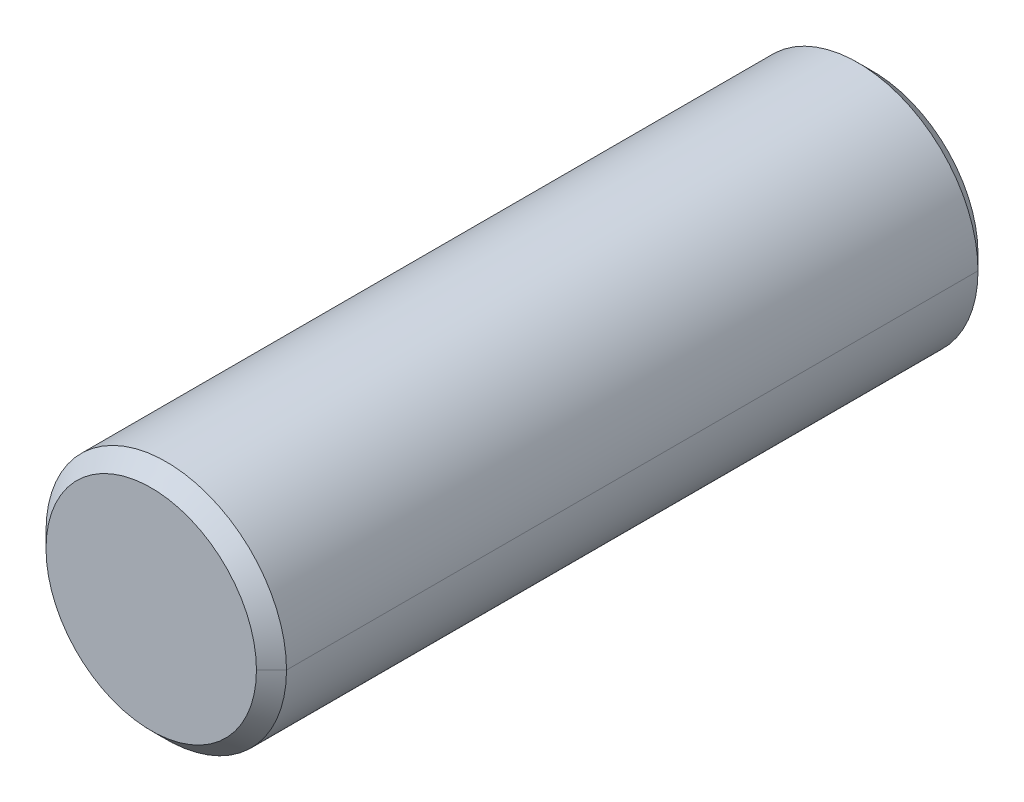
ISO-10303-21;
HEADER;
FILE_DESCRIPTION(('STEP AP214'),'2;1');
FILE_NAME('part.step','',(''),(''),'','','');
FILE_SCHEMA(('AUTOMOTIVE_DESIGN { 1 0 10303 214 1 1 1 1 }'));
ENDSEC;
DATA;
#1=APPLICATION_CONTEXT('core data for automotive mechanical design processes');
#2=APPLICATION_PROTOCOL_DEFINITION('international standard','automotive_design',2000,#1);
#3=PRODUCT_CONTEXT('',#1,'mechanical');
#4=PRODUCT('Part','Part','',(#3));
#5=PRODUCT_RELATED_PRODUCT_CATEGORY('part','',(#4));
#6=PRODUCT_DEFINITION_FORMATION('','',#4);
#7=PRODUCT_DEFINITION_CONTEXT('part definition',#1,'design');
#8=PRODUCT_DEFINITION('design','',#6,#7);
#9=PRODUCT_DEFINITION_SHAPE('','',#8);
#10=(LENGTH_UNIT() NAMED_UNIT(*) SI_UNIT(.MILLI.,.METRE.));
#11=(NAMED_UNIT(*) PLANE_ANGLE_UNIT() SI_UNIT($,.RADIAN.));
#12=(NAMED_UNIT(*) SI_UNIT($,.STERADIAN.) SOLID_ANGLE_UNIT());
#13=UNCERTAINTY_MEASURE_WITH_UNIT(LENGTH_MEASURE(1.E-05),#10,'distance_accuracy_value','');
#14=(GEOMETRIC_REPRESENTATION_CONTEXT(3) GLOBAL_UNCERTAINTY_ASSIGNED_CONTEXT((#13)) GLOBAL_UNIT_ASSIGNED_CONTEXT((#10,
#11,#12)) REPRESENTATION_CONTEXT('',''));
#15=CARTESIAN_POINT('',(0.,0.,0.));
#16=DIRECTION('',(0.,0.,1.));
#17=DIRECTION('',(1.,0.,0.));
#18=AXIS2_PLACEMENT_3D('',#15,#16,#17);
#19=CARTESIAN_POINT('',(0.,0.,6.));
#20=DIRECTION('',(0.,0.,-1.));
#21=DIRECTION('',(-1.,0.,0.));
#22=AXIS2_PLACEMENT_3D('',#19,#20,#21);
#23=CONICAL_SURFACE('',#22,1.75,0.785398163397448);
#24=DIRECTION('',(0.707106781186552,0.,-0.707106781186544));
#25=VECTOR('',#24,1.);
#26=CARTESIAN_POINT('',(1.75,0.,6.));
#27=LINE('',#26,#25);
#28=CARTESIAN_POINT('',(1.75,0.,6.));
#29=VERTEX_POINT('',#28);
#30=CARTESIAN_POINT('',(2.,0.,5.75));
#31=VERTEX_POINT('',#30);
#32=EDGE_CURVE('E78',#29,#31,#27,.T.);
#33=ORIENTED_EDGE('',*,*,#32,.F.);
#34=CARTESIAN_POINT('',(0.,0.,6.));
#35=DIRECTION('',(0.,0.,1.));
#36=DIRECTION('',(1.,0.,0.));
#37=AXIS2_PLACEMENT_3D('',#34,#35,#36);
#38=CIRCLE('',#37,1.75);
#39=CARTESIAN_POINT('',(-1.75,0.,6.));
#40=VERTEX_POINT('',#39);
#41=EDGE_CURVE('E27',#40,#29,#38,.T.);
#42=ORIENTED_EDGE('',*,*,#41,.F.);
#43=DIRECTION('',(-0.707106781186552,0.,-0.707106781186544));
#44=VECTOR('',#43,1.);
#45=CARTESIAN_POINT('',(-1.75,0.,6.));
#46=LINE('',#45,#44);
#47=CARTESIAN_POINT('',(-2.,0.,5.75));
#48=VERTEX_POINT('',#47);
#49=EDGE_CURVE('E86',#40,#48,#46,.T.);
#50=ORIENTED_EDGE('',*,*,#49,.T.);
#51=CARTESIAN_POINT('',(0.,0.,5.75));
#52=DIRECTION('',(0.,0.,-1.));
#53=DIRECTION('',(1.,0.,0.));
#54=AXIS2_PLACEMENT_3D('',#51,#52,#53);
#55=CIRCLE('',#54,2.);
#56=EDGE_CURVE('E79',#31,#48,#55,.T.);
#57=ORIENTED_EDGE('',*,*,#56,.F.);
#58=EDGE_LOOP('',(#33,#42,#50,#57));
#59=FACE_BOUND('',#58,.T.);
#60=ADVANCED_FACE('F16',(#59),#23,.T.);
#61=CARTESIAN_POINT('',(0.,0.,-5.75));
#62=DIRECTION('',(0.,0.,1.));
#63=DIRECTION('',(1.,0.,0.));
#64=AXIS2_PLACEMENT_3D('',#61,#62,#63);
#65=CONICAL_SURFACE('',#64,2.,0.78539816339745);
#66=DIRECTION('',(-0.707106781186553,0.,0.707106781186542));
#67=VECTOR('',#66,1.);
#68=CARTESIAN_POINT('',(-2.,0.,-5.75));
#69=LINE('',#68,#67);
#70=CARTESIAN_POINT('',(-1.74999999999998,0.,-6.));
#71=VERTEX_POINT('',#70);
#72=CARTESIAN_POINT('',(-2.,0.,-5.75));
#73=VERTEX_POINT('',#72);
#74=EDGE_CURVE('E99',#71,#73,#69,.T.);
#75=ORIENTED_EDGE('',*,*,#74,.F.);
#76=CARTESIAN_POINT('',(0.,0.,-6.));
#77=DIRECTION('',(0.,0.,-1.));
#78=DIRECTION('',(1.,0.,0.));
#79=AXIS2_PLACEMENT_3D('',#76,#77,#78);
#80=CIRCLE('',#79,1.75);
#81=CARTESIAN_POINT('',(1.75000000000004,0.,-6.));
#82=VERTEX_POINT('',#81);
#83=EDGE_CURVE('E11',#82,#71,#80,.T.);
#84=ORIENTED_EDGE('',*,*,#83,.F.);
#85=DIRECTION('',(0.707106781186553,0.,0.707106781186542));
#86=VECTOR('',#85,1.);
#87=CARTESIAN_POINT('',(2.,0.,-5.75));
#88=LINE('',#87,#86);
#89=CARTESIAN_POINT('',(2.,0.,-5.75));
#90=VERTEX_POINT('',#89);
#91=EDGE_CURVE('E98',#82,#90,#88,.T.);
#92=ORIENTED_EDGE('',*,*,#91,.T.);
#93=CARTESIAN_POINT('',(0.,0.,-5.75));
#94=DIRECTION('',(0.,0.,1.));
#95=DIRECTION('',(1.,0.,0.));
#96=AXIS2_PLACEMENT_3D('',#93,#94,#95);
#97=CIRCLE('',#96,2.);
#98=EDGE_CURVE('E42',#73,#90,#97,.T.);
#99=ORIENTED_EDGE('',*,*,#98,.F.);
#100=EDGE_LOOP('',(#75,#84,#92,#99));
#101=FACE_BOUND('',#100,.T.);
#102=ADVANCED_FACE('F179',(#101),#65,.T.);
#103=CARTESIAN_POINT('',(0.,0.,-6.));
#104=DIRECTION('',(0.,0.,1.));
#105=DIRECTION('',(0.,-1.,0.));
#106=AXIS2_PLACEMENT_3D('',#103,#104,#105);
#107=PLANE('',#106);
#108=ORIENTED_EDGE('',*,*,#83,.T.);
#109=CARTESIAN_POINT('',(0.,0.,-6.));
#110=DIRECTION('',(0.,0.,-1.));
#111=DIRECTION('',(1.,0.,0.));
#112=AXIS2_PLACEMENT_3D('',#109,#110,#111);
#113=CIRCLE('',#112,1.75);
#114=EDGE_CURVE('E114',#71,#82,#113,.T.);
#115=ORIENTED_EDGE('',*,*,#114,.T.);
#116=EDGE_LOOP('',(#108,#115));
#117=FACE_BOUND('',#116,.T.);
#118=ADVANCED_FACE('F175',(#117),#107,.F.);
#119=CARTESIAN_POINT('',(0.,0.,6.));
#120=DIRECTION('',(0.,0.,1.));
#121=DIRECTION('',(0.,-1.,0.));
#122=AXIS2_PLACEMENT_3D('',#119,#120,#121);
#123=PLANE('',#122);
#124=ORIENTED_EDGE('',*,*,#41,.T.);
#125=CARTESIAN_POINT('',(0.,0.,6.));
#126=DIRECTION('',(0.,0.,1.));
#127=DIRECTION('',(1.,0.,0.));
#128=AXIS2_PLACEMENT_3D('',#125,#126,#127);
#129=CIRCLE('',#128,1.75);
#130=EDGE_CURVE('E71',#29,#40,#129,.T.);
#131=ORIENTED_EDGE('',*,*,#130,.T.);
#132=EDGE_LOOP('',(#124,#131));
#133=FACE_BOUND('',#132,.T.);
#134=ADVANCED_FACE('F69',(#133),#123,.T.);
#135=CARTESIAN_POINT('',(0.,0.,6.));
#136=DIRECTION('',(0.,0.,-1.));
#137=DIRECTION('',(-1.,0.,0.));
#138=AXIS2_PLACEMENT_3D('',#135,#136,#137);
#139=CYLINDRICAL_SURFACE('',#138,2.);
#140=DIRECTION('',(0.,0.,-1.));
#141=VECTOR('',#140,1.);
#142=CARTESIAN_POINT('',(2.,0.,6.));
#143=LINE('',#142,#141);
#144=EDGE_CURVE('E20',#31,#90,#143,.T.);
#145=ORIENTED_EDGE('',*,*,#144,.F.);
#146=ORIENTED_EDGE('',*,*,#56,.T.);
#147=DIRECTION('',(0.,0.,-1.));
#148=VECTOR('',#147,1.);
#149=CARTESIAN_POINT('',(-2.00000000000003,0.,6.));
#150=LINE('',#149,#148);
#151=EDGE_CURVE('E103',#48,#73,#150,.T.);
#152=ORIENTED_EDGE('',*,*,#151,.T.);
#153=ORIENTED_EDGE('',*,*,#98,.T.);
#154=EDGE_LOOP('',(#145,#146,#152,#153));
#155=FACE_BOUND('',#154,.T.);
#156=ADVANCED_FACE('F18',(#155),#139,.T.);
#157=CARTESIAN_POINT('',(0.,0.,6.));
#158=DIRECTION('',(0.,0.,-1.));
#159=DIRECTION('',(-1.,0.,0.));
#160=AXIS2_PLACEMENT_3D('',#157,#158,#159);
#161=CYLINDRICAL_SURFACE('',#160,2.);
#162=CARTESIAN_POINT('',(0.,0.,5.75));
#163=DIRECTION('',(0.,0.,-1.));
#164=DIRECTION('',(1.,0.,0.));
#165=AXIS2_PLACEMENT_3D('',#162,#163,#164);
#166=CIRCLE('',#165,2.);
#167=EDGE_CURVE('E83',#48,#31,#166,.T.);
#168=ORIENTED_EDGE('',*,*,#167,.T.);
#169=ORIENTED_EDGE('',*,*,#144,.T.);
#170=CARTESIAN_POINT('',(0.,0.,-5.75));
#171=DIRECTION('',(0.,0.,1.));
#172=DIRECTION('',(1.,0.,0.));
#173=AXIS2_PLACEMENT_3D('',#170,#171,#172);
#174=CIRCLE('',#173,2.);
#175=EDGE_CURVE('E95',#90,#73,#174,.T.);
#176=ORIENTED_EDGE('',*,*,#175,.T.);
#177=ORIENTED_EDGE('',*,*,#151,.F.);
#178=EDGE_LOOP('',(#168,#169,#176,#177));
#179=FACE_BOUND('',#178,.T.);
#180=ADVANCED_FACE('F126',(#179),#161,.T.);
#181=CARTESIAN_POINT('',(0.,0.,-5.75));
#182=DIRECTION('',(0.,0.,1.));
#183=DIRECTION('',(1.,0.,0.));
#184=AXIS2_PLACEMENT_3D('',#181,#182,#183);
#185=CONICAL_SURFACE('',#184,2.,0.78539816339745);
#186=ORIENTED_EDGE('',*,*,#114,.F.);
#187=ORIENTED_EDGE('',*,*,#74,.T.);
#188=ORIENTED_EDGE('',*,*,#175,.F.);
#189=ORIENTED_EDGE('',*,*,#91,.F.);
#190=EDGE_LOOP('',(#186,#187,#188,#189));
#191=FACE_BOUND('',#190,.T.);
#192=ADVANCED_FACE('F170',(#191),#185,.T.);
#193=CARTESIAN_POINT('',(0.,0.,6.));
#194=DIRECTION('',(0.,0.,-1.));
#195=DIRECTION('',(-1.,0.,0.));
#196=AXIS2_PLACEMENT_3D('',#193,#194,#195);
#197=CONICAL_SURFACE('',#196,1.75,0.785398163397448);
#198=ORIENTED_EDGE('',*,*,#130,.F.);
#199=ORIENTED_EDGE('',*,*,#32,.T.);
#200=ORIENTED_EDGE('',*,*,#167,.F.);
#201=ORIENTED_EDGE('',*,*,#49,.F.);
#202=EDGE_LOOP('',(#198,#199,#200,#201));
#203=FACE_BOUND('',#202,.T.);
#204=ADVANCED_FACE('F85',(#203),#197,.T.);
#205=CLOSED_SHELL('',(#60,#102,#118,#134,#156,#180,#192,#204));
#206=MANIFOLD_SOLID_BREP('B1',#205);
#207=ADVANCED_BREP_SHAPE_REPRESENTATION('',(#18,#206),#14);
#208=SHAPE_DEFINITION_REPRESENTATION(#9,#207);
ENDSEC;
END-ISO-10303-21;
